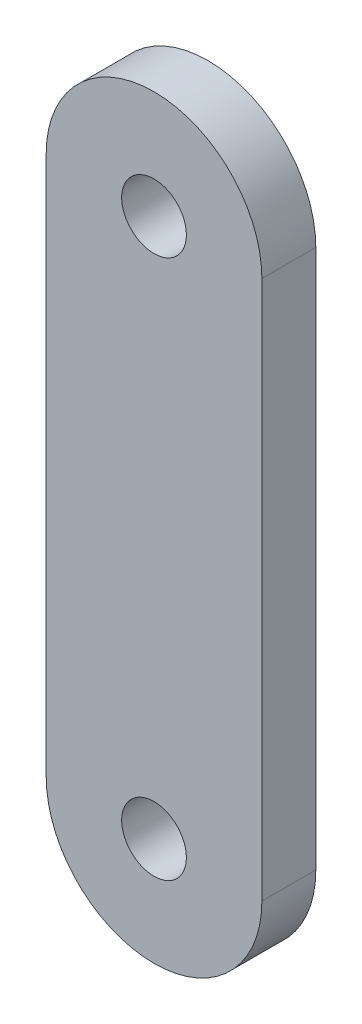
ISO-10303-21;
HEADER;
FILE_DESCRIPTION(('STEP AP214'),'2;1');
FILE_NAME('part.step','',(''),(''),'','','');
FILE_SCHEMA(('AUTOMOTIVE_DESIGN { 1 0 10303 214 1 1 1 1 }'));
ENDSEC;
DATA;
#1=APPLICATION_CONTEXT('core data for automotive mechanical design processes');
#2=APPLICATION_PROTOCOL_DEFINITION('international standard','automotive_design',2000,#1);
#3=PRODUCT_CONTEXT('',#1,'mechanical');
#4=PRODUCT('Part','Part','',(#3));
#5=PRODUCT_RELATED_PRODUCT_CATEGORY('part','',(#4));
#6=PRODUCT_DEFINITION_FORMATION('','',#4);
#7=PRODUCT_DEFINITION_CONTEXT('part definition',#1,'design');
#8=PRODUCT_DEFINITION('design','',#6,#7);
#9=PRODUCT_DEFINITION_SHAPE('','',#8);
#10=(LENGTH_UNIT() NAMED_UNIT(*) SI_UNIT(.MILLI.,.METRE.));
#11=(NAMED_UNIT(*) PLANE_ANGLE_UNIT() SI_UNIT($,.RADIAN.));
#12=(NAMED_UNIT(*) SI_UNIT($,.STERADIAN.) SOLID_ANGLE_UNIT());
#13=UNCERTAINTY_MEASURE_WITH_UNIT(LENGTH_MEASURE(1.E-05),#10,'distance_accuracy_value','');
#14=(GEOMETRIC_REPRESENTATION_CONTEXT(3) GLOBAL_UNCERTAINTY_ASSIGNED_CONTEXT((#13)) GLOBAL_UNIT_ASSIGNED_CONTEXT((#10,
#11,#12)) REPRESENTATION_CONTEXT('',''));
#15=CARTESIAN_POINT('',(0.,0.,0.));
#16=DIRECTION('',(0.,0.,1.));
#17=DIRECTION('',(1.,0.,0.));
#18=AXIS2_PLACEMENT_3D('',#15,#16,#17);
#19=CARTESIAN_POINT('',(0.,25.,2.5));
#20=DIRECTION('',(0.,0.,1.));
#21=DIRECTION('',(1.,0.,0.));
#22=AXIS2_PLACEMENT_3D('',#19,#20,#21);
#23=PLANE('',#22);
#24=CARTESIAN_POINT('',(0.,0.,2.5));
#25=DIRECTION('',(0.,0.,1.));
#26=DIRECTION('',(1.,0.,0.));
#27=AXIS2_PLACEMENT_3D('',#24,#25,#26);
#28=CIRCLE('',#27,1.5);
#29=CARTESIAN_POINT('',(1.5,0.,2.5));
#30=VERTEX_POINT('',#29);
#31=EDGE_CURVE('E99',#30,#30,#28,.T.);
#32=ORIENTED_EDGE('',*,*,#31,.F.);
#33=EDGE_LOOP('',(#32));
#34=FACE_BOUND('',#33,.T.);
#35=CARTESIAN_POINT('',(0.,25.,2.5));
#36=DIRECTION('',(0.,0.,1.));
#37=DIRECTION('',(1.,0.,0.));
#38=AXIS2_PLACEMENT_3D('',#35,#36,#37);
#39=CIRCLE('',#38,5.);
#40=CARTESIAN_POINT('',(5.,25.,2.5));
#41=VERTEX_POINT('',#40);
#42=CARTESIAN_POINT('',(-5.,25.,2.5));
#43=VERTEX_POINT('',#42);
#44=EDGE_CURVE('E84',#41,#43,#39,.T.);
#45=ORIENTED_EDGE('',*,*,#44,.T.);
#46=DIRECTION('',(0.,-1.,0.));
#47=VECTOR('',#46,1.);
#48=CARTESIAN_POINT('',(-5.,25.,2.5));
#49=LINE('',#48,#47);
#50=CARTESIAN_POINT('',(-5.,0.,2.5));
#51=VERTEX_POINT('',#50);
#52=EDGE_CURVE('E79',#43,#51,#49,.T.);
#53=ORIENTED_EDGE('',*,*,#52,.T.);
#54=CARTESIAN_POINT('',(0.,0.,2.5));
#55=DIRECTION('',(0.,0.,1.));
#56=DIRECTION('',(1.,0.,0.));
#57=AXIS2_PLACEMENT_3D('',#54,#55,#56);
#58=CIRCLE('',#57,5.);
#59=CARTESIAN_POINT('',(5.,0.,2.5));
#60=VERTEX_POINT('',#59);
#61=EDGE_CURVE('E82',#51,#60,#58,.T.);
#62=ORIENTED_EDGE('',*,*,#61,.T.);
#63=DIRECTION('',(0.,1.,0.));
#64=VECTOR('',#63,1.);
#65=CARTESIAN_POINT('',(5.,0.,2.5));
#66=LINE('',#65,#64);
#67=EDGE_CURVE('E49',#60,#41,#66,.T.);
#68=ORIENTED_EDGE('',*,*,#67,.T.);
#69=EDGE_LOOP('',(#45,#53,#62,#68));
#70=FACE_BOUND('',#69,.T.);
#71=CARTESIAN_POINT('',(0.,25.,2.5));
#72=DIRECTION('',(0.,0.,1.));
#73=DIRECTION('',(1.,0.,0.));
#74=AXIS2_PLACEMENT_3D('',#71,#72,#73);
#75=CIRCLE('',#74,1.5);
#76=CARTESIAN_POINT('',(1.5,25.,2.5));
#77=VERTEX_POINT('',#76);
#78=EDGE_CURVE('E114',#77,#77,#75,.T.);
#79=ORIENTED_EDGE('',*,*,#78,.F.);
#80=EDGE_LOOP('',(#79));
#81=FACE_BOUND('',#80,.T.);
#82=ADVANCED_FACE('F32',(#34,#70,#81),#23,.T.);
#83=CARTESIAN_POINT('',(0.,25.,0.));
#84=DIRECTION('',(0.,0.,1.));
#85=DIRECTION('',(1.,0.,0.));
#86=AXIS2_PLACEMENT_3D('',#83,#84,#85);
#87=PLANE('',#86);
#88=CARTESIAN_POINT('',(0.,0.,0.));
#89=DIRECTION('',(0.,0.,1.));
#90=DIRECTION('',(1.,0.,0.));
#91=AXIS2_PLACEMENT_3D('',#88,#89,#90);
#92=CIRCLE('',#91,1.5);
#93=CARTESIAN_POINT('',(1.5,0.,0.));
#94=VERTEX_POINT('',#93);
#95=EDGE_CURVE('E111',#94,#94,#92,.T.);
#96=ORIENTED_EDGE('',*,*,#95,.T.);
#97=EDGE_LOOP('',(#96));
#98=FACE_BOUND('',#97,.T.);
#99=CARTESIAN_POINT('',(0.,25.,0.));
#100=DIRECTION('',(0.,0.,1.));
#101=DIRECTION('',(1.,0.,0.));
#102=AXIS2_PLACEMENT_3D('',#99,#100,#101);
#103=CIRCLE('',#102,5.);
#104=CARTESIAN_POINT('',(5.,25.,0.));
#105=VERTEX_POINT('',#104);
#106=CARTESIAN_POINT('',(-5.,25.,0.));
#107=VERTEX_POINT('',#106);
#108=EDGE_CURVE('E96',#105,#107,#103,.T.);
#109=ORIENTED_EDGE('',*,*,#108,.F.);
#110=DIRECTION('',(0.,1.,0.));
#111=VECTOR('',#110,1.);
#112=CARTESIAN_POINT('',(5.,0.,0.));
#113=LINE('',#112,#111);
#114=CARTESIAN_POINT('',(5.,0.,0.));
#115=VERTEX_POINT('',#114);
#116=EDGE_CURVE('E72',#115,#105,#113,.T.);
#117=ORIENTED_EDGE('',*,*,#116,.F.);
#118=CARTESIAN_POINT('',(0.,0.,0.));
#119=DIRECTION('',(0.,0.,1.));
#120=DIRECTION('',(1.,0.,0.));
#121=AXIS2_PLACEMENT_3D('',#118,#119,#120);
#122=CIRCLE('',#121,5.);
#123=CARTESIAN_POINT('',(-5.,0.,0.));
#124=VERTEX_POINT('',#123);
#125=EDGE_CURVE('E66',#124,#115,#122,.T.);
#126=ORIENTED_EDGE('',*,*,#125,.F.);
#127=DIRECTION('',(0.,-1.,0.));
#128=VECTOR('',#127,1.);
#129=CARTESIAN_POINT('',(-5.,25.,0.));
#130=LINE('',#129,#128);
#131=EDGE_CURVE('E88',#107,#124,#130,.T.);
#132=ORIENTED_EDGE('',*,*,#131,.F.);
#133=EDGE_LOOP('',(#109,#117,#126,#132));
#134=FACE_BOUND('',#133,.T.);
#135=CARTESIAN_POINT('',(0.,25.,0.));
#136=DIRECTION('',(0.,0.,1.));
#137=DIRECTION('',(1.,0.,0.));
#138=AXIS2_PLACEMENT_3D('',#135,#136,#137);
#139=CIRCLE('',#138,1.5);
#140=CARTESIAN_POINT('',(1.5,25.,0.));
#141=VERTEX_POINT('',#140);
#142=EDGE_CURVE('E117',#141,#141,#139,.T.);
#143=ORIENTED_EDGE('',*,*,#142,.T.);
#144=EDGE_LOOP('',(#143));
#145=FACE_BOUND('',#144,.T.);
#146=ADVANCED_FACE('F107',(#98,#134,#145),#87,.F.);
#147=CARTESIAN_POINT('',(0.,25.,2.5));
#148=DIRECTION('',(0.,0.,-1.));
#149=DIRECTION('',(-1.,0.,0.));
#150=AXIS2_PLACEMENT_3D('',#147,#148,#149);
#151=CYLINDRICAL_SURFACE('',#150,5.);
#152=ORIENTED_EDGE('',*,*,#108,.T.);
#153=DIRECTION('',(0.,0.,-1.));
#154=VECTOR('',#153,1.);
#155=CARTESIAN_POINT('',(-5.,25.,2.5));
#156=LINE('',#155,#154);
#157=EDGE_CURVE('E11',#43,#107,#156,.T.);
#158=ORIENTED_EDGE('',*,*,#157,.F.);
#159=ORIENTED_EDGE('',*,*,#44,.F.);
#160=DIRECTION('',(0.,0.,-1.));
#161=VECTOR('',#160,1.);
#162=CARTESIAN_POINT('',(5.,25.,2.5));
#163=LINE('',#162,#161);
#164=EDGE_CURVE('E92',#41,#105,#163,.T.);
#165=ORIENTED_EDGE('',*,*,#164,.T.);
#166=EDGE_LOOP('',(#152,#158,#159,#165));
#167=FACE_BOUND('',#166,.T.);
#168=ADVANCED_FACE('F34',(#167),#151,.T.);
#169=CARTESIAN_POINT('',(-5.,25.,2.5));
#170=DIRECTION('',(1.,0.,0.));
#171=DIRECTION('',(0.,1.,0.));
#172=AXIS2_PLACEMENT_3D('',#169,#170,#171);
#173=PLANE('',#172);
#174=ORIENTED_EDGE('',*,*,#131,.T.);
#175=DIRECTION('',(0.,0.,-1.));
#176=VECTOR('',#175,1.);
#177=CARTESIAN_POINT('',(-5.,0.,2.5));
#178=LINE('',#177,#176);
#179=EDGE_CURVE('E41',#51,#124,#178,.T.);
#180=ORIENTED_EDGE('',*,*,#179,.F.);
#181=ORIENTED_EDGE('',*,*,#52,.F.);
#182=ORIENTED_EDGE('',*,*,#157,.T.);
#183=EDGE_LOOP('',(#174,#180,#181,#182));
#184=FACE_BOUND('',#183,.T.);
#185=ADVANCED_FACE('F87',(#184),#173,.F.);
#186=CARTESIAN_POINT('',(0.,0.,2.5));
#187=DIRECTION('',(0.,0.,-1.));
#188=DIRECTION('',(-1.,0.,0.));
#189=AXIS2_PLACEMENT_3D('',#186,#187,#188);
#190=CYLINDRICAL_SURFACE('',#189,5.);
#191=ORIENTED_EDGE('',*,*,#125,.T.);
#192=DIRECTION('',(0.,0.,-1.));
#193=VECTOR('',#192,1.);
#194=CARTESIAN_POINT('',(5.,0.,2.5));
#195=LINE('',#194,#193);
#196=EDGE_CURVE('E89',#60,#115,#195,.T.);
#197=ORIENTED_EDGE('',*,*,#196,.F.);
#198=ORIENTED_EDGE('',*,*,#61,.F.);
#199=ORIENTED_EDGE('',*,*,#179,.T.);
#200=EDGE_LOOP('',(#191,#197,#198,#199));
#201=FACE_BOUND('',#200,.T.);
#202=ADVANCED_FACE('F90',(#201),#190,.T.);
#203=CARTESIAN_POINT('',(5.,0.,2.5));
#204=DIRECTION('',(-1.,0.,0.));
#205=DIRECTION('',(0.,-1.,0.));
#206=AXIS2_PLACEMENT_3D('',#203,#204,#205);
#207=PLANE('',#206);
#208=ORIENTED_EDGE('',*,*,#116,.T.);
#209=ORIENTED_EDGE('',*,*,#164,.F.);
#210=ORIENTED_EDGE('',*,*,#67,.F.);
#211=ORIENTED_EDGE('',*,*,#196,.T.);
#212=EDGE_LOOP('',(#208,#209,#210,#211));
#213=FACE_BOUND('',#212,.T.);
#214=ADVANCED_FACE('F104',(#213),#207,.F.);
#215=CARTESIAN_POINT('',(0.,0.,2.5));
#216=DIRECTION('',(0.,0.,-1.));
#217=DIRECTION('',(-1.,0.,0.));
#218=AXIS2_PLACEMENT_3D('',#215,#216,#217);
#219=CYLINDRICAL_SURFACE('',#218,1.5);
#220=ORIENTED_EDGE('',*,*,#31,.T.);
#221=EDGE_LOOP('',(#220));
#222=FACE_BOUND('',#221,.T.);
#223=ORIENTED_EDGE('',*,*,#95,.F.);
#224=EDGE_LOOP('',(#223));
#225=FACE_BOUND('',#224,.T.);
#226=ADVANCED_FACE('F135',(#222,#225),#219,.F.);
#227=CARTESIAN_POINT('',(0.,25.,2.5));
#228=DIRECTION('',(0.,0.,-1.));
#229=DIRECTION('',(-1.,0.,0.));
#230=AXIS2_PLACEMENT_3D('',#227,#228,#229);
#231=CYLINDRICAL_SURFACE('',#230,1.5);
#232=ORIENTED_EDGE('',*,*,#78,.T.);
#233=EDGE_LOOP('',(#232));
#234=FACE_BOUND('',#233,.T.);
#235=ORIENTED_EDGE('',*,*,#142,.F.);
#236=EDGE_LOOP('',(#235));
#237=FACE_BOUND('',#236,.T.);
#238=ADVANCED_FACE('F123',(#234,#237),#231,.F.);
#239=CLOSED_SHELL('',(#82,#146,#168,#185,#202,#214,#226,#238));
#240=MANIFOLD_SOLID_BREP('B2',#239);
#241=ADVANCED_BREP_SHAPE_REPRESENTATION('',(#18,#240),#14);
#242=SHAPE_DEFINITION_REPRESENTATION(#9,#241);
ENDSEC;
END-ISO-10303-21;
